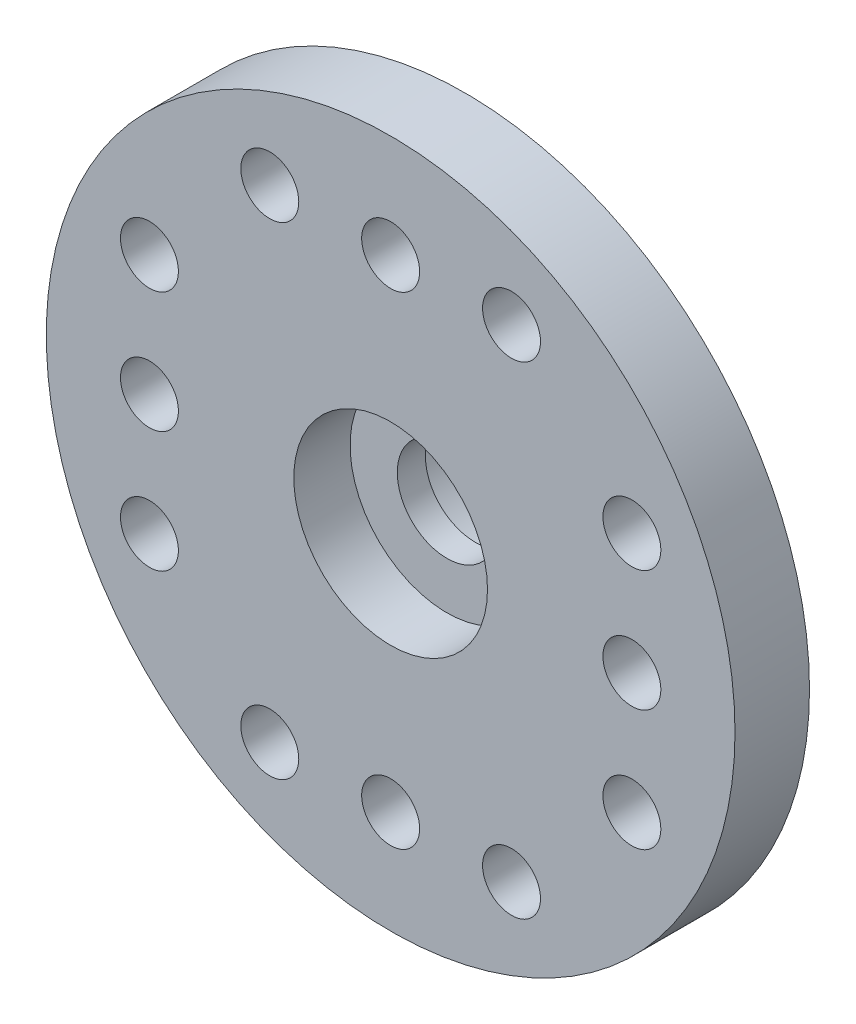
ISO-10303-21;
HEADER;
FILE_DESCRIPTION(('STEP AP214'),'2;1');
FILE_NAME('part.step','',(''),(''),'','','');
FILE_SCHEMA(('AUTOMOTIVE_DESIGN { 1 0 10303 214 1 1 1 1 }'));
ENDSEC;
DATA;
#1=APPLICATION_CONTEXT('core data for automotive mechanical design processes');
#2=APPLICATION_PROTOCOL_DEFINITION('international standard','automotive_design',2000,#1);
#3=PRODUCT_CONTEXT('',#1,'mechanical');
#4=PRODUCT('Part','Part','',(#3));
#5=PRODUCT_RELATED_PRODUCT_CATEGORY('part','',(#4));
#6=PRODUCT_DEFINITION_FORMATION('','',#4);
#7=PRODUCT_DEFINITION_CONTEXT('part definition',#1,'design');
#8=PRODUCT_DEFINITION('design','',#6,#7);
#9=PRODUCT_DEFINITION_SHAPE('','',#8);
#10=(LENGTH_UNIT() NAMED_UNIT(*) SI_UNIT(.MILLI.,.METRE.));
#11=(NAMED_UNIT(*) PLANE_ANGLE_UNIT() SI_UNIT($,.RADIAN.));
#12=(NAMED_UNIT(*) SI_UNIT($,.STERADIAN.) SOLID_ANGLE_UNIT());
#13=UNCERTAINTY_MEASURE_WITH_UNIT(LENGTH_MEASURE(1.E-05),#10,'distance_accuracy_value','');
#14=(GEOMETRIC_REPRESENTATION_CONTEXT(3) GLOBAL_UNCERTAINTY_ASSIGNED_CONTEXT((#13)) GLOBAL_UNIT_ASSIGNED_CONTEXT((#10,
#11,#12)) REPRESENTATION_CONTEXT('',''));
#15=CARTESIAN_POINT('',(0.,0.,0.));
#16=DIRECTION('',(0.,0.,1.));
#17=DIRECTION('',(1.,0.,0.));
#18=AXIS2_PLACEMENT_3D('',#15,#16,#17);
#19=CARTESIAN_POINT('',(9.62,10.,-7.54264068711929));
#20=DIRECTION('',(0.,0.,1.));
#21=DIRECTION('',(1.,0.,0.));
#22=AXIS2_PLACEMENT_3D('',#19,#20,#21);
#23=CYLINDRICAL_SURFACE('',#22,1.5);
#24=CARTESIAN_POINT('',(9.62,10.,0.55));
#25=DIRECTION('',(0.,0.,1.));
#26=DIRECTION('',(1.,0.,0.));
#27=AXIS2_PLACEMENT_3D('',#24,#25,#26);
#28=CIRCLE('',#27,1.5);
#29=CARTESIAN_POINT('',(11.12,10.,0.55));
#30=VERTEX_POINT('',#29);
#31=EDGE_CURVE('E89',#30,#30,#28,.F.);
#32=ORIENTED_EDGE('',*,*,#31,.F.);
#33=EDGE_LOOP('',(#32));
#34=FACE_BOUND('',#33,.T.);
#35=CARTESIAN_POINT('',(9.62,10.,-0.3));
#36=DIRECTION('',(0.,0.,-1.));
#37=DIRECTION('',(-1.,0.,0.));
#38=AXIS2_PLACEMENT_3D('',#35,#36,#37);
#39=CIRCLE('',#38,1.5);
#40=CARTESIAN_POINT('',(8.12,10.,-0.3));
#41=VERTEX_POINT('',#40);
#42=EDGE_CURVE('E36',#41,#41,#39,.F.);
#43=ORIENTED_EDGE('',*,*,#42,.F.);
#44=EDGE_LOOP('',(#43));
#45=FACE_BOUND('',#44,.T.);
#46=ADVANCED_FACE('F32',(#34,#45),#23,.F.);
#47=CARTESIAN_POINT('',(9.62,10.,2.25));
#48=DIRECTION('',(0.,0.,-1.));
#49=DIRECTION('',(-1.,0.,0.));
#50=AXIS2_PLACEMENT_3D('',#47,#48,#49);
#51=CYLINDRICAL_SURFACE('',#50,10.4);
#52=CARTESIAN_POINT('',(9.62,10.,2.25));
#53=DIRECTION('',(0.,0.,1.));
#54=DIRECTION('',(1.,0.,0.));
#55=AXIS2_PLACEMENT_3D('',#52,#53,#54);
#56=CIRCLE('',#55,10.4);
#57=CARTESIAN_POINT('',(20.02,10.,2.25));
#58=VERTEX_POINT('',#57);
#59=EDGE_CURVE('E40',#58,#58,#56,.T.);
#60=ORIENTED_EDGE('',*,*,#59,.F.);
#61=EDGE_LOOP('',(#60));
#62=FACE_BOUND('',#61,.T.);
#63=CARTESIAN_POINT('',(9.62,10.,0.));
#64=DIRECTION('',(0.,0.,1.));
#65=DIRECTION('',(1.,0.,0.));
#66=AXIS2_PLACEMENT_3D('',#63,#64,#65);
#67=CIRCLE('',#66,10.4);
#68=CARTESIAN_POINT('',(20.02,10.,0.));
#69=VERTEX_POINT('',#68);
#70=EDGE_CURVE('E45',#69,#69,#67,.T.);
#71=ORIENTED_EDGE('',*,*,#70,.T.);
#72=EDGE_LOOP('',(#71));
#73=FACE_BOUND('',#72,.T.);
#74=ADVANCED_FACE('F34',(#62,#73),#51,.T.);
#75=CARTESIAN_POINT('',(9.62,10.,2.25));
#76=DIRECTION('',(0.,0.,1.));
#77=DIRECTION('',(1.,0.,0.));
#78=AXIS2_PLACEMENT_3D('',#75,#76,#77);
#79=PLANE('',#78);
#80=CARTESIAN_POINT('',(9.62,10.,2.25));
#81=DIRECTION('',(0.,0.,1.));
#82=DIRECTION('',(1.,0.,0.));
#83=AXIS2_PLACEMENT_3D('',#80,#81,#82);
#84=CIRCLE('',#83,2.925);
#85=CARTESIAN_POINT('',(12.545,10.,2.25));
#86=VERTEX_POINT('',#85);
#87=EDGE_CURVE('E99',#86,#86,#84,.T.);
#88=ORIENTED_EDGE('',*,*,#87,.F.);
#89=EDGE_LOOP('',(#88));
#90=FACE_BOUND('',#89,.T.);
#91=CARTESIAN_POINT('',(13.27,17.285,2.25));
#92=DIRECTION('',(0.,0.,1.));
#93=DIRECTION('',(1.,0.,0.));
#94=AXIS2_PLACEMENT_3D('',#91,#92,#93);
#95=CIRCLE('',#94,0.875);
#96=CARTESIAN_POINT('',(14.145,17.285,2.25));
#97=VERTEX_POINT('',#96);
#98=EDGE_CURVE('E115',#97,#97,#95,.T.);
#99=ORIENTED_EDGE('',*,*,#98,.F.);
#100=EDGE_LOOP('',(#99));
#101=FACE_BOUND('',#100,.T.);
#102=CARTESIAN_POINT('',(9.62,17.285,2.25));
#103=DIRECTION('',(0.,0.,1.));
#104=DIRECTION('',(1.,0.,0.));
#105=AXIS2_PLACEMENT_3D('',#102,#103,#104);
#106=CIRCLE('',#105,0.875);
#107=CARTESIAN_POINT('',(10.495,17.285,2.25));
#108=VERTEX_POINT('',#107);
#109=EDGE_CURVE('E125',#108,#108,#106,.T.);
#110=ORIENTED_EDGE('',*,*,#109,.F.);
#111=EDGE_LOOP('',(#110));
#112=FACE_BOUND('',#111,.T.);
#113=CARTESIAN_POINT('',(2.335,6.35,2.25));
#114=DIRECTION('',(0.,0.,1.));
#115=DIRECTION('',(1.,0.,0.));
#116=AXIS2_PLACEMENT_3D('',#113,#114,#115);
#117=CIRCLE('',#116,0.875000000000001);
#118=CARTESIAN_POINT('',(3.21,6.35,2.25));
#119=VERTEX_POINT('',#118);
#120=EDGE_CURVE('E122',#119,#119,#117,.T.);
#121=ORIENTED_EDGE('',*,*,#120,.F.);
#122=EDGE_LOOP('',(#121));
#123=FACE_BOUND('',#122,.T.);
#124=CARTESIAN_POINT('',(2.335,13.65,2.25));
#125=DIRECTION('',(0.,0.,1.));
#126=DIRECTION('',(1.,0.,0.));
#127=AXIS2_PLACEMENT_3D('',#124,#125,#126);
#128=CIRCLE('',#127,0.874999999999998);
#129=CARTESIAN_POINT('',(3.21,13.65,2.25));
#130=VERTEX_POINT('',#129);
#131=EDGE_CURVE('E118',#130,#130,#128,.T.);
#132=ORIENTED_EDGE('',*,*,#131,.F.);
#133=EDGE_LOOP('',(#132));
#134=FACE_BOUND('',#133,.T.);
#135=CARTESIAN_POINT('',(9.62,2.715,2.25));
#136=DIRECTION('',(0.,0.,1.));
#137=DIRECTION('',(1.,0.,0.));
#138=AXIS2_PLACEMENT_3D('',#135,#136,#137);
#139=CIRCLE('',#138,0.875);
#140=CARTESIAN_POINT('',(10.495,2.715,2.25));
#141=VERTEX_POINT('',#140);
#142=EDGE_CURVE('E57',#141,#141,#139,.T.);
#143=ORIENTED_EDGE('',*,*,#142,.F.);
#144=EDGE_LOOP('',(#143));
#145=FACE_BOUND('',#144,.T.);
#146=CARTESIAN_POINT('',(5.97,2.715,2.25));
#147=DIRECTION('',(0.,0.,1.));
#148=DIRECTION('',(1.,0.,0.));
#149=AXIS2_PLACEMENT_3D('',#146,#147,#148);
#150=CIRCLE('',#149,0.875);
#151=CARTESIAN_POINT('',(6.845,2.715,2.25));
#152=VERTEX_POINT('',#151);
#153=EDGE_CURVE('E133',#152,#152,#150,.T.);
#154=ORIENTED_EDGE('',*,*,#153,.F.);
#155=EDGE_LOOP('',(#154));
#156=FACE_BOUND('',#155,.T.);
#157=CARTESIAN_POINT('',(13.27,2.715,2.25));
#158=DIRECTION('',(0.,0.,1.));
#159=DIRECTION('',(1.,0.,0.));
#160=AXIS2_PLACEMENT_3D('',#157,#158,#159);
#161=CIRCLE('',#160,0.875);
#162=CARTESIAN_POINT('',(14.145,2.715,2.25));
#163=VERTEX_POINT('',#162);
#164=EDGE_CURVE('E130',#163,#163,#161,.T.);
#165=ORIENTED_EDGE('',*,*,#164,.F.);
#166=EDGE_LOOP('',(#165));
#167=FACE_BOUND('',#166,.T.);
#168=CARTESIAN_POINT('',(2.335,10.,2.25));
#169=DIRECTION('',(0.,0.,1.));
#170=DIRECTION('',(1.,0.,0.));
#171=AXIS2_PLACEMENT_3D('',#168,#169,#170);
#172=CIRCLE('',#171,0.875000000000001);
#173=CARTESIAN_POINT('',(3.21,10.,2.25));
#174=VERTEX_POINT('',#173);
#175=EDGE_CURVE('E121',#174,#174,#172,.T.);
#176=ORIENTED_EDGE('',*,*,#175,.F.);
#177=EDGE_LOOP('',(#176));
#178=FACE_BOUND('',#177,.T.);
#179=CARTESIAN_POINT('',(16.905,13.65,2.25));
#180=DIRECTION('',(0.,0.,1.));
#181=DIRECTION('',(1.,0.,0.));
#182=AXIS2_PLACEMENT_3D('',#179,#180,#181);
#183=CIRCLE('',#182,0.875000000000002);
#184=CARTESIAN_POINT('',(17.78,13.65,2.25));
#185=VERTEX_POINT('',#184);
#186=EDGE_CURVE('E91',#185,#185,#183,.T.);
#187=ORIENTED_EDGE('',*,*,#186,.F.);
#188=EDGE_LOOP('',(#187));
#189=FACE_BOUND('',#188,.T.);
#190=CARTESIAN_POINT('',(16.905,6.35,2.25));
#191=DIRECTION('',(0.,0.,1.));
#192=DIRECTION('',(1.,0.,0.));
#193=AXIS2_PLACEMENT_3D('',#190,#191,#192);
#194=CIRCLE('',#193,0.875000000000002);
#195=CARTESIAN_POINT('',(17.78,6.35,2.25));
#196=VERTEX_POINT('',#195);
#197=EDGE_CURVE('E96',#196,#196,#194,.T.);
#198=ORIENTED_EDGE('',*,*,#197,.F.);
#199=EDGE_LOOP('',(#198));
#200=FACE_BOUND('',#199,.T.);
#201=CARTESIAN_POINT('',(16.905,10.,2.25));
#202=DIRECTION('',(0.,0.,1.));
#203=DIRECTION('',(1.,0.,0.));
#204=AXIS2_PLACEMENT_3D('',#201,#202,#203);
#205=CIRCLE('',#204,0.875000000000002);
#206=CARTESIAN_POINT('',(17.78,10.,2.25));
#207=VERTEX_POINT('',#206);
#208=EDGE_CURVE('E110',#207,#207,#205,.T.);
#209=ORIENTED_EDGE('',*,*,#208,.F.);
#210=EDGE_LOOP('',(#209));
#211=FACE_BOUND('',#210,.T.);
#212=CARTESIAN_POINT('',(5.97,17.285,2.25));
#213=DIRECTION('',(0.,0.,1.));
#214=DIRECTION('',(1.,0.,0.));
#215=AXIS2_PLACEMENT_3D('',#212,#213,#214);
#216=CIRCLE('',#215,0.875);
#217=CARTESIAN_POINT('',(6.845,17.285,2.25));
#218=VERTEX_POINT('',#217);
#219=EDGE_CURVE('E112',#218,#218,#216,.T.);
#220=ORIENTED_EDGE('',*,*,#219,.F.);
#221=EDGE_LOOP('',(#220));
#222=FACE_BOUND('',#221,.T.);
#223=ORIENTED_EDGE('',*,*,#59,.T.);
#224=EDGE_LOOP('',(#223));
#225=FACE_BOUND('',#224,.T.);
#226=ADVANCED_FACE('F143',(#90,#101,#112,#123,#134,#145,#156,#167,#178,#189,#200,#211,#222,
#225),#79,.T.);
#227=CARTESIAN_POINT('',(9.62,10.,0.));
#228=DIRECTION('',(0.,0.,1.));
#229=DIRECTION('',(1.,0.,0.));
#230=AXIS2_PLACEMENT_3D('',#227,#228,#229);
#231=PLANE('',#230);
#232=CARTESIAN_POINT('',(13.27,17.285,0.));
#233=DIRECTION('',(0.,0.,1.));
#234=DIRECTION('',(1.,0.,0.));
#235=AXIS2_PLACEMENT_3D('',#232,#233,#234);
#236=CIRCLE('',#235,0.875);
#237=CARTESIAN_POINT('',(14.145,17.285,0.));
#238=VERTEX_POINT('',#237);
#239=EDGE_CURVE('E87',#238,#238,#236,.T.);
#240=ORIENTED_EDGE('',*,*,#239,.T.);
#241=EDGE_LOOP('',(#240));
#242=FACE_BOUND('',#241,.T.);
#243=CARTESIAN_POINT('',(9.62,17.285,0.));
#244=DIRECTION('',(0.,0.,1.));
#245=DIRECTION('',(1.,0.,0.));
#246=AXIS2_PLACEMENT_3D('',#243,#244,#245);
#247=CIRCLE('',#246,0.875);
#248=CARTESIAN_POINT('',(10.495,17.285,0.));
#249=VERTEX_POINT('',#248);
#250=EDGE_CURVE('E84',#249,#249,#247,.T.);
#251=ORIENTED_EDGE('',*,*,#250,.T.);
#252=EDGE_LOOP('',(#251));
#253=FACE_BOUND('',#252,.T.);
#254=CARTESIAN_POINT('',(2.335,6.35,0.));
#255=DIRECTION('',(0.,0.,1.));
#256=DIRECTION('',(1.,0.,0.));
#257=AXIS2_PLACEMENT_3D('',#254,#255,#256);
#258=CIRCLE('',#257,0.875000000000001);
#259=CARTESIAN_POINT('',(3.21,6.35,0.));
#260=VERTEX_POINT('',#259);
#261=EDGE_CURVE('E81',#260,#260,#258,.T.);
#262=ORIENTED_EDGE('',*,*,#261,.T.);
#263=EDGE_LOOP('',(#262));
#264=FACE_BOUND('',#263,.T.);
#265=CARTESIAN_POINT('',(2.335,13.65,0.));
#266=DIRECTION('',(0.,0.,1.));
#267=DIRECTION('',(1.,0.,0.));
#268=AXIS2_PLACEMENT_3D('',#265,#266,#267);
#269=CIRCLE('',#268,0.874999999999998);
#270=CARTESIAN_POINT('',(3.21,13.65,0.));
#271=VERTEX_POINT('',#270);
#272=EDGE_CURVE('E78',#271,#271,#269,.T.);
#273=ORIENTED_EDGE('',*,*,#272,.T.);
#274=EDGE_LOOP('',(#273));
#275=FACE_BOUND('',#274,.T.);
#276=CARTESIAN_POINT('',(9.62,2.715,0.));
#277=DIRECTION('',(0.,0.,1.));
#278=DIRECTION('',(1.,0.,0.));
#279=AXIS2_PLACEMENT_3D('',#276,#277,#278);
#280=CIRCLE('',#279,0.875);
#281=CARTESIAN_POINT('',(10.495,2.715,0.));
#282=VERTEX_POINT('',#281);
#283=EDGE_CURVE('E75',#282,#282,#280,.T.);
#284=ORIENTED_EDGE('',*,*,#283,.T.);
#285=EDGE_LOOP('',(#284));
#286=FACE_BOUND('',#285,.T.);
#287=CARTESIAN_POINT('',(5.97,2.715,0.));
#288=DIRECTION('',(0.,0.,1.));
#289=DIRECTION('',(1.,0.,0.));
#290=AXIS2_PLACEMENT_3D('',#287,#288,#289);
#291=CIRCLE('',#290,0.875);
#292=CARTESIAN_POINT('',(6.845,2.715,0.));
#293=VERTEX_POINT('',#292);
#294=EDGE_CURVE('E72',#293,#293,#291,.T.);
#295=ORIENTED_EDGE('',*,*,#294,.T.);
#296=EDGE_LOOP('',(#295));
#297=FACE_BOUND('',#296,.T.);
#298=CARTESIAN_POINT('',(13.27,2.715,0.));
#299=DIRECTION('',(0.,0.,1.));
#300=DIRECTION('',(1.,0.,0.));
#301=AXIS2_PLACEMENT_3D('',#298,#299,#300);
#302=CIRCLE('',#301,0.875);
#303=CARTESIAN_POINT('',(14.145,2.715,0.));
#304=VERTEX_POINT('',#303);
#305=EDGE_CURVE('E69',#304,#304,#302,.T.);
#306=ORIENTED_EDGE('',*,*,#305,.T.);
#307=EDGE_LOOP('',(#306));
#308=FACE_BOUND('',#307,.T.);
#309=CARTESIAN_POINT('',(2.335,10.,0.));
#310=DIRECTION('',(0.,0.,1.));
#311=DIRECTION('',(1.,0.,0.));
#312=AXIS2_PLACEMENT_3D('',#309,#310,#311);
#313=CIRCLE('',#312,0.875000000000001);
#314=CARTESIAN_POINT('',(3.21,10.,0.));
#315=VERTEX_POINT('',#314);
#316=EDGE_CURVE('E66',#315,#315,#313,.T.);
#317=ORIENTED_EDGE('',*,*,#316,.T.);
#318=EDGE_LOOP('',(#317));
#319=FACE_BOUND('',#318,.T.);
#320=CARTESIAN_POINT('',(16.905,13.65,0.));
#321=DIRECTION('',(0.,0.,1.));
#322=DIRECTION('',(1.,0.,0.));
#323=AXIS2_PLACEMENT_3D('',#320,#321,#322);
#324=CIRCLE('',#323,0.875000000000002);
#325=CARTESIAN_POINT('',(17.78,13.65,0.));
#326=VERTEX_POINT('',#325);
#327=EDGE_CURVE('E63',#326,#326,#324,.T.);
#328=ORIENTED_EDGE('',*,*,#327,.T.);
#329=EDGE_LOOP('',(#328));
#330=FACE_BOUND('',#329,.T.);
#331=CARTESIAN_POINT('',(16.905,6.35,0.));
#332=DIRECTION('',(0.,0.,1.));
#333=DIRECTION('',(1.,0.,0.));
#334=AXIS2_PLACEMENT_3D('',#331,#332,#333);
#335=CIRCLE('',#334,0.875000000000002);
#336=CARTESIAN_POINT('',(17.78,6.35,0.));
#337=VERTEX_POINT('',#336);
#338=EDGE_CURVE('E60',#337,#337,#335,.T.);
#339=ORIENTED_EDGE('',*,*,#338,.T.);
#340=EDGE_LOOP('',(#339));
#341=FACE_BOUND('',#340,.T.);
#342=CARTESIAN_POINT('',(16.905,10.,0.));
#343=DIRECTION('',(0.,0.,1.));
#344=DIRECTION('',(1.,0.,0.));
#345=AXIS2_PLACEMENT_3D('',#342,#343,#344);
#346=CIRCLE('',#345,0.875000000000002);
#347=CARTESIAN_POINT('',(17.78,10.,0.));
#348=VERTEX_POINT('',#347);
#349=EDGE_CURVE('E56',#348,#348,#346,.T.);
#350=ORIENTED_EDGE('',*,*,#349,.T.);
#351=EDGE_LOOP('',(#350));
#352=FACE_BOUND('',#351,.T.);
#353=CARTESIAN_POINT('',(5.97,17.285,0.));
#354=DIRECTION('',(0.,0.,1.));
#355=DIRECTION('',(1.,0.,0.));
#356=AXIS2_PLACEMENT_3D('',#353,#354,#355);
#357=CIRCLE('',#356,0.875);
#358=CARTESIAN_POINT('',(6.845,17.285,0.));
#359=VERTEX_POINT('',#358);
#360=EDGE_CURVE('E53',#359,#359,#357,.T.);
#361=ORIENTED_EDGE('',*,*,#360,.T.);
#362=EDGE_LOOP('',(#361));
#363=FACE_BOUND('',#362,.T.);
#364=CARTESIAN_POINT('',(9.62,10.,0.));
#365=DIRECTION('',(0.,0.,-1.));
#366=DIRECTION('',(-1.,0.,0.));
#367=AXIS2_PLACEMENT_3D('',#364,#365,#366);
#368=CIRCLE('',#367,4.4);
#369=CARTESIAN_POINT('',(5.22,10.,0.));
#370=VERTEX_POINT('',#369);
#371=EDGE_CURVE('E10',#370,#370,#368,.T.);
#372=ORIENTED_EDGE('',*,*,#371,.F.);
#373=EDGE_LOOP('',(#372));
#374=FACE_BOUND('',#373,.T.);
#375=ORIENTED_EDGE('',*,*,#70,.F.);
#376=EDGE_LOOP('',(#375));
#377=FACE_BOUND('',#376,.T.);
#378=ADVANCED_FACE('F146',(#242,#253,#264,#275,#286,#297,#308,#319,#330,#341,#352,#363,#374,
#377),#231,.F.);
#379=CARTESIAN_POINT('',(9.62,10.,-3.3));
#380=DIRECTION('',(0.,0.,1.));
#381=DIRECTION('',(1.,0.,0.));
#382=AXIS2_PLACEMENT_3D('',#379,#380,#381);
#383=CYLINDRICAL_SURFACE('',#382,4.4);
#384=CARTESIAN_POINT('',(9.62,10.,-3.3));
#385=DIRECTION('',(0.,0.,-1.));
#386=DIRECTION('',(-1.,0.,0.));
#387=AXIS2_PLACEMENT_3D('',#384,#385,#386);
#388=CIRCLE('',#387,4.4);
#389=CARTESIAN_POINT('',(5.22,10.,-3.3));
#390=VERTEX_POINT('',#389);
#391=EDGE_CURVE('E48',#390,#390,#388,.T.);
#392=ORIENTED_EDGE('',*,*,#391,.F.);
#393=EDGE_LOOP('',(#392));
#394=FACE_BOUND('',#393,.T.);
#395=ORIENTED_EDGE('',*,*,#371,.T.);
#396=EDGE_LOOP('',(#395));
#397=FACE_BOUND('',#396,.T.);
#398=ADVANCED_FACE('F168',(#394,#397),#383,.T.);
#399=CARTESIAN_POINT('',(9.62,10.,-3.3));
#400=DIRECTION('',(0.,0.,-1.));
#401=DIRECTION('',(-1.,0.,0.));
#402=AXIS2_PLACEMENT_3D('',#399,#400,#401);
#403=PLANE('',#402);
#404=CARTESIAN_POINT('',(9.62,10.,-3.3));
#405=DIRECTION('',(0.,0.,-1.));
#406=DIRECTION('',(-1.,0.,0.));
#407=AXIS2_PLACEMENT_3D('',#404,#405,#406);
#408=CIRCLE('',#407,2.95);
#409=CARTESIAN_POINT('',(6.67,10.,-3.3));
#410=VERTEX_POINT('',#409);
#411=EDGE_CURVE('E106',#410,#410,#408,.T.);
#412=ORIENTED_EDGE('',*,*,#411,.F.);
#413=EDGE_LOOP('',(#412));
#414=FACE_BOUND('',#413,.T.);
#415=ORIENTED_EDGE('',*,*,#391,.T.);
#416=EDGE_LOOP('',(#415));
#417=FACE_BOUND('',#416,.T.);
#418=ADVANCED_FACE('F173',(#414,#417),#403,.T.);
#419=CARTESIAN_POINT('',(5.97,17.285,-7.54264068711929));
#420=DIRECTION('',(0.,0.,1.));
#421=DIRECTION('',(1.,0.,0.));
#422=AXIS2_PLACEMENT_3D('',#419,#420,#421);
#423=CYLINDRICAL_SURFACE('',#422,0.875);
#424=ORIENTED_EDGE('',*,*,#219,.T.);
#425=EDGE_LOOP('',(#424));
#426=FACE_BOUND('',#425,.T.);
#427=ORIENTED_EDGE('',*,*,#360,.F.);
#428=EDGE_LOOP('',(#427));
#429=FACE_BOUND('',#428,.T.);
#430=ADVANCED_FACE('F187',(#426,#429),#423,.F.);
#431=CARTESIAN_POINT('',(16.905,10.,-7.54264068711929));
#432=DIRECTION('',(0.,0.,1.));
#433=DIRECTION('',(1.,0.,0.));
#434=AXIS2_PLACEMENT_3D('',#431,#432,#433);
#435=CYLINDRICAL_SURFACE('',#434,0.875000000000002);
#436=ORIENTED_EDGE('',*,*,#208,.T.);
#437=EDGE_LOOP('',(#436));
#438=FACE_BOUND('',#437,.T.);
#439=ORIENTED_EDGE('',*,*,#349,.F.);
#440=EDGE_LOOP('',(#439));
#441=FACE_BOUND('',#440,.T.);
#442=ADVANCED_FACE('F192',(#438,#441),#435,.F.);
#443=CARTESIAN_POINT('',(16.905,6.35,-7.54264068711929));
#444=DIRECTION('',(0.,0.,1.));
#445=DIRECTION('',(1.,0.,0.));
#446=AXIS2_PLACEMENT_3D('',#443,#444,#445);
#447=CYLINDRICAL_SURFACE('',#446,0.875000000000002);
#448=ORIENTED_EDGE('',*,*,#197,.T.);
#449=EDGE_LOOP('',(#448));
#450=FACE_BOUND('',#449,.T.);
#451=ORIENTED_EDGE('',*,*,#338,.F.);
#452=EDGE_LOOP('',(#451));
#453=FACE_BOUND('',#452,.T.);
#454=ADVANCED_FACE('F226',(#450,#453),#447,.F.);
#455=CARTESIAN_POINT('',(16.905,13.65,-7.54264068711929));
#456=DIRECTION('',(0.,0.,1.));
#457=DIRECTION('',(1.,0.,0.));
#458=AXIS2_PLACEMENT_3D('',#455,#456,#457);
#459=CYLINDRICAL_SURFACE('',#458,0.875000000000002);
#460=ORIENTED_EDGE('',*,*,#186,.T.);
#461=EDGE_LOOP('',(#460));
#462=FACE_BOUND('',#461,.T.);
#463=ORIENTED_EDGE('',*,*,#327,.F.);
#464=EDGE_LOOP('',(#463));
#465=FACE_BOUND('',#464,.T.);
#466=ADVANCED_FACE('F229',(#462,#465),#459,.F.);
#467=CARTESIAN_POINT('',(2.335,10.,-7.54264068711929));
#468=DIRECTION('',(0.,0.,1.));
#469=DIRECTION('',(1.,0.,0.));
#470=AXIS2_PLACEMENT_3D('',#467,#468,#469);
#471=CYLINDRICAL_SURFACE('',#470,0.875000000000001);
#472=ORIENTED_EDGE('',*,*,#175,.T.);
#473=EDGE_LOOP('',(#472));
#474=FACE_BOUND('',#473,.T.);
#475=ORIENTED_EDGE('',*,*,#316,.F.);
#476=EDGE_LOOP('',(#475));
#477=FACE_BOUND('',#476,.T.);
#478=ADVANCED_FACE('F232',(#474,#477),#471,.F.);
#479=CARTESIAN_POINT('',(13.27,2.715,-7.54264068711929));
#480=DIRECTION('',(0.,0.,1.));
#481=DIRECTION('',(1.,0.,0.));
#482=AXIS2_PLACEMENT_3D('',#479,#480,#481);
#483=CYLINDRICAL_SURFACE('',#482,0.875);
#484=ORIENTED_EDGE('',*,*,#164,.T.);
#485=EDGE_LOOP('',(#484));
#486=FACE_BOUND('',#485,.T.);
#487=ORIENTED_EDGE('',*,*,#305,.F.);
#488=EDGE_LOOP('',(#487));
#489=FACE_BOUND('',#488,.T.);
#490=ADVANCED_FACE('F254',(#486,#489),#483,.F.);
#491=CARTESIAN_POINT('',(5.97,2.715,-7.54264068711929));
#492=DIRECTION('',(0.,0.,1.));
#493=DIRECTION('',(1.,0.,0.));
#494=AXIS2_PLACEMENT_3D('',#491,#492,#493);
#495=CYLINDRICAL_SURFACE('',#494,0.875);
#496=ORIENTED_EDGE('',*,*,#153,.T.);
#497=EDGE_LOOP('',(#496));
#498=FACE_BOUND('',#497,.T.);
#499=ORIENTED_EDGE('',*,*,#294,.F.);
#500=EDGE_LOOP('',(#499));
#501=FACE_BOUND('',#500,.T.);
#502=ADVANCED_FACE('F140',(#498,#501),#495,.F.);
#503=CARTESIAN_POINT('',(9.62,2.715,-7.54264068711929));
#504=DIRECTION('',(0.,0.,1.));
#505=DIRECTION('',(1.,0.,0.));
#506=AXIS2_PLACEMENT_3D('',#503,#504,#505);
#507=CYLINDRICAL_SURFACE('',#506,0.875);
#508=ORIENTED_EDGE('',*,*,#142,.T.);
#509=EDGE_LOOP('',(#508));
#510=FACE_BOUND('',#509,.T.);
#511=ORIENTED_EDGE('',*,*,#283,.F.);
#512=EDGE_LOOP('',(#511));
#513=FACE_BOUND('',#512,.T.);
#514=ADVANCED_FACE('F242',(#510,#513),#507,.F.);
#515=CARTESIAN_POINT('',(2.335,13.65,-7.54264068711929));
#516=DIRECTION('',(0.,0.,1.));
#517=DIRECTION('',(1.,0.,0.));
#518=AXIS2_PLACEMENT_3D('',#515,#516,#517);
#519=CYLINDRICAL_SURFACE('',#518,0.874999999999998);
#520=ORIENTED_EDGE('',*,*,#131,.T.);
#521=EDGE_LOOP('',(#520));
#522=FACE_BOUND('',#521,.T.);
#523=ORIENTED_EDGE('',*,*,#272,.F.);
#524=EDGE_LOOP('',(#523));
#525=FACE_BOUND('',#524,.T.);
#526=ADVANCED_FACE('F238',(#522,#525),#519,.F.);
#527=CARTESIAN_POINT('',(2.335,6.35,-7.54264068711929));
#528=DIRECTION('',(0.,0.,1.));
#529=DIRECTION('',(1.,0.,0.));
#530=AXIS2_PLACEMENT_3D('',#527,#528,#529);
#531=CYLINDRICAL_SURFACE('',#530,0.875000000000001);
#532=ORIENTED_EDGE('',*,*,#120,.T.);
#533=EDGE_LOOP('',(#532));
#534=FACE_BOUND('',#533,.T.);
#535=ORIENTED_EDGE('',*,*,#261,.F.);
#536=EDGE_LOOP('',(#535));
#537=FACE_BOUND('',#536,.T.);
#538=ADVANCED_FACE('F241',(#534,#537),#531,.F.);
#539=CARTESIAN_POINT('',(9.62,17.285,-7.54264068711929));
#540=DIRECTION('',(0.,0.,1.));
#541=DIRECTION('',(1.,0.,0.));
#542=AXIS2_PLACEMENT_3D('',#539,#540,#541);
#543=CYLINDRICAL_SURFACE('',#542,0.875);
#544=ORIENTED_EDGE('',*,*,#109,.T.);
#545=EDGE_LOOP('',(#544));
#546=FACE_BOUND('',#545,.T.);
#547=ORIENTED_EDGE('',*,*,#250,.F.);
#548=EDGE_LOOP('',(#547));
#549=FACE_BOUND('',#548,.T.);
#550=ADVANCED_FACE('F246',(#546,#549),#543,.F.);
#551=CARTESIAN_POINT('',(13.27,17.285,-7.54264068711929));
#552=DIRECTION('',(0.,0.,1.));
#553=DIRECTION('',(1.,0.,0.));
#554=AXIS2_PLACEMENT_3D('',#551,#552,#553);
#555=CYLINDRICAL_SURFACE('',#554,0.875);
#556=ORIENTED_EDGE('',*,*,#98,.T.);
#557=EDGE_LOOP('',(#556));
#558=FACE_BOUND('',#557,.T.);
#559=ORIENTED_EDGE('',*,*,#239,.F.);
#560=EDGE_LOOP('',(#559));
#561=FACE_BOUND('',#560,.T.);
#562=ADVANCED_FACE('F224',(#558,#561),#555,.F.);
#563=CARTESIAN_POINT('',(9.62,10.,0.55));
#564=DIRECTION('',(0.,0.,1.));
#565=DIRECTION('',(1.,0.,0.));
#566=AXIS2_PLACEMENT_3D('',#563,#564,#565);
#567=PLANE('',#566);
#568=CARTESIAN_POINT('',(9.62,10.,0.55));
#569=DIRECTION('',(0.,0.,1.));
#570=DIRECTION('',(1.,0.,0.));
#571=AXIS2_PLACEMENT_3D('',#568,#569,#570);
#572=CIRCLE('',#571,2.925);
#573=CARTESIAN_POINT('',(12.545,10.,0.55));
#574=VERTEX_POINT('',#573);
#575=EDGE_CURVE('E92',#574,#574,#572,.T.);
#576=ORIENTED_EDGE('',*,*,#575,.T.);
#577=EDGE_LOOP('',(#576));
#578=FACE_BOUND('',#577,.T.);
#579=ORIENTED_EDGE('',*,*,#31,.T.);
#580=EDGE_LOOP('',(#579));
#581=FACE_BOUND('',#580,.T.);
#582=ADVANCED_FACE('F219',(#578,#581),#567,.T.);
#583=CARTESIAN_POINT('',(9.62,10.,0.55));
#584=DIRECTION('',(0.,0.,1.));
#585=DIRECTION('',(1.,0.,0.));
#586=AXIS2_PLACEMENT_3D('',#583,#584,#585);
#587=CYLINDRICAL_SURFACE('',#586,2.925);
#588=ORIENTED_EDGE('',*,*,#575,.F.);
#589=EDGE_LOOP('',(#588));
#590=FACE_BOUND('',#589,.T.);
#591=ORIENTED_EDGE('',*,*,#87,.T.);
#592=EDGE_LOOP('',(#591));
#593=FACE_BOUND('',#592,.T.);
#594=ADVANCED_FACE('F211',(#590,#593),#587,.F.);
#595=CARTESIAN_POINT('',(9.62,10.,-0.3));
#596=DIRECTION('',(0.,0.,-1.));
#597=DIRECTION('',(-1.,0.,0.));
#598=AXIS2_PLACEMENT_3D('',#595,#596,#597);
#599=PLANE('',#598);
#600=CARTESIAN_POINT('',(9.62,10.,-0.3));
#601=DIRECTION('',(0.,0.,-1.));
#602=DIRECTION('',(-1.,0.,0.));
#603=AXIS2_PLACEMENT_3D('',#600,#601,#602);
#604=CIRCLE('',#603,2.95);
#605=CARTESIAN_POINT('',(6.67,10.,-0.3));
#606=VERTEX_POINT('',#605);
#607=EDGE_CURVE('E201',#606,#606,#604,.T.);
#608=ORIENTED_EDGE('',*,*,#607,.T.);
#609=EDGE_LOOP('',(#608));
#610=FACE_BOUND('',#609,.T.);
#611=ORIENTED_EDGE('',*,*,#42,.T.);
#612=EDGE_LOOP('',(#611));
#613=FACE_BOUND('',#612,.T.);
#614=ADVANCED_FACE('F208',(#610,#613),#599,.T.);
#615=CARTESIAN_POINT('',(9.62,10.,-0.3));
#616=DIRECTION('',(0.,0.,-1.));
#617=DIRECTION('',(-1.,0.,0.));
#618=AXIS2_PLACEMENT_3D('',#615,#616,#617);
#619=CYLINDRICAL_SURFACE('',#618,2.95);
#620=ORIENTED_EDGE('',*,*,#607,.F.);
#621=EDGE_LOOP('',(#620));
#622=FACE_BOUND('',#621,.T.);
#623=ORIENTED_EDGE('',*,*,#411,.T.);
#624=EDGE_LOOP('',(#623));
#625=FACE_BOUND('',#624,.T.);
#626=ADVANCED_FACE('F210',(#622,#625),#619,.F.);
#627=CLOSED_SHELL('',(#46,#74,#226,#378,#398,#418,#430,#442,#454,#466,#478,#490,#502,#514,#526,
#538,#550,#562,#582,#594,#614,#626));
#628=MANIFOLD_SOLID_BREP('B2',#627);
#629=ADVANCED_BREP_SHAPE_REPRESENTATION('',(#18,#628),#14);
#630=SHAPE_DEFINITION_REPRESENTATION(#9,#629);
ENDSEC;
END-ISO-10303-21;
